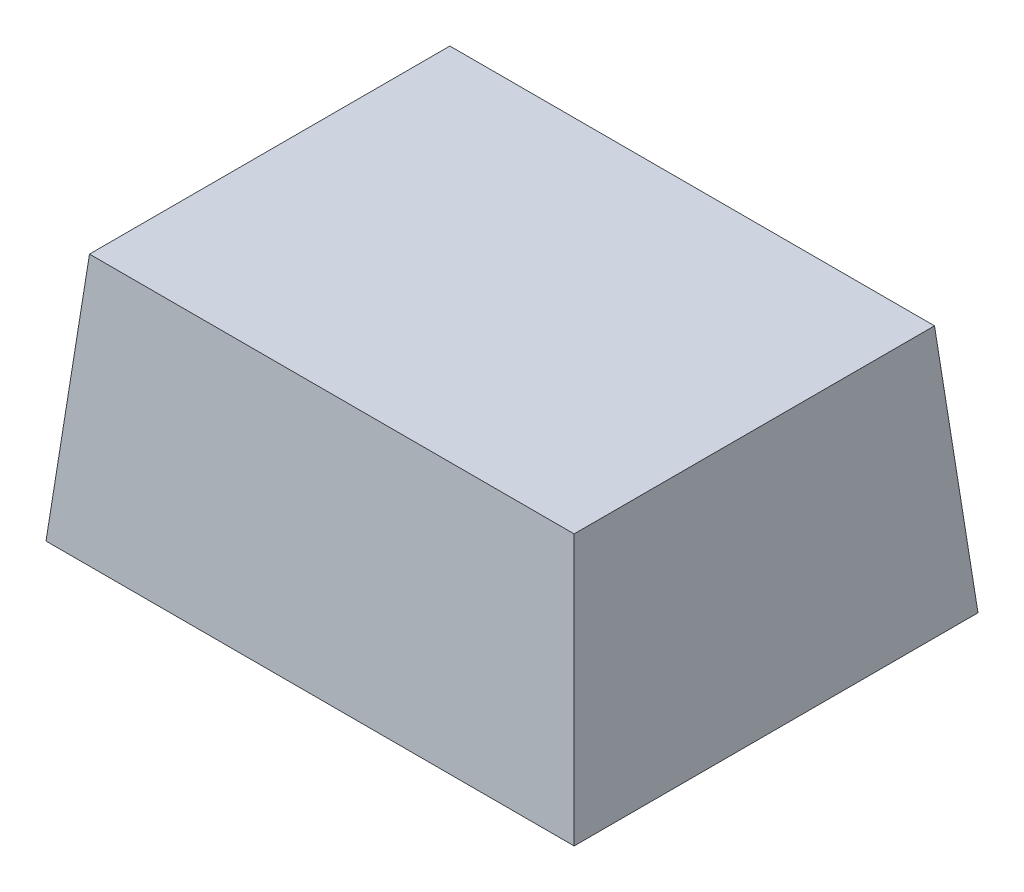
ISO-10303-21;
HEADER;
FILE_DESCRIPTION(('STEP AP214'),'2;1');
FILE_NAME('part.step','',(''),(''),'','','');
FILE_SCHEMA(('AUTOMOTIVE_DESIGN { 1 0 10303 214 1 1 1 1 }'));
ENDSEC;
DATA;
#1=APPLICATION_CONTEXT('core data for automotive mechanical design processes');
#2=APPLICATION_PROTOCOL_DEFINITION('international standard','automotive_design',2000,#1);
#3=PRODUCT_CONTEXT('',#1,'mechanical');
#4=PRODUCT('Part','Part','',(#3));
#5=PRODUCT_RELATED_PRODUCT_CATEGORY('part','',(#4));
#6=PRODUCT_DEFINITION_FORMATION('','',#4);
#7=PRODUCT_DEFINITION_CONTEXT('part definition',#1,'design');
#8=PRODUCT_DEFINITION('design','',#6,#7);
#9=PRODUCT_DEFINITION_SHAPE('','',#8);
#10=(LENGTH_UNIT() NAMED_UNIT(*) SI_UNIT(.MILLI.,.METRE.));
#11=(NAMED_UNIT(*) PLANE_ANGLE_UNIT() SI_UNIT($,.RADIAN.));
#12=(NAMED_UNIT(*) SI_UNIT($,.STERADIAN.) SOLID_ANGLE_UNIT());
#13=UNCERTAINTY_MEASURE_WITH_UNIT(LENGTH_MEASURE(1.E-05),#10,'distance_accuracy_value','');
#14=(GEOMETRIC_REPRESENTATION_CONTEXT(3) GLOBAL_UNCERTAINTY_ASSIGNED_CONTEXT((#13)) GLOBAL_UNIT_ASSIGNED_CONTEXT((#10,
#11,#12)) REPRESENTATION_CONTEXT('',''));
#15=CARTESIAN_POINT('',(0.,0.,0.));
#16=DIRECTION('',(0.,0.,1.));
#17=DIRECTION('',(1.,0.,0.));
#18=AXIS2_PLACEMENT_3D('',#15,#16,#17);
#19=CARTESIAN_POINT('',(0.425,0.,0.325));
#20=DIRECTION('',(0.996194698091746,0.0871557427476582,0.));
#21=DIRECTION('',(-0.0871557427476582,0.996194698091746,0.));
#22=AXIS2_PLACEMENT_3D('',#19,#20,#21);
#23=PLANE('',#22);
#24=DIRECTION('',(0.,0.,-1.));
#25=VECTOR('',#24,1.);
#26=CARTESIAN_POINT('',(0.425,0.,0.325));
#27=LINE('',#26,#25);
#28=CARTESIAN_POINT('',(0.425,0.,0.325));
#29=VERTEX_POINT('',#28);
#30=CARTESIAN_POINT('',(0.425,0.,-0.325));
#31=VERTEX_POINT('',#30);
#32=EDGE_CURVE('E86',#29,#31,#27,.T.);
#33=ORIENTED_EDGE('',*,*,#32,.T.);
#34=DIRECTION('',(0.0868265938642476,-0.992432509138967,-0.0868265938642476));
#35=VECTOR('',#34,1.);
#36=CARTESIAN_POINT('',(0.418591971208243,0.0732441042473825,-0.318591971208243));
#37=LINE('',#36,#35);
#38=CARTESIAN_POINT('',(0.39000453458963,0.4,-0.29000453458963));
#39=VERTEX_POINT('',#38);
#40=EDGE_CURVE('E11',#39,#31,#37,.T.);
#41=ORIENTED_EDGE('',*,*,#40,.F.);
#42=DIRECTION('',(0.,0.,1.));
#43=VECTOR('',#42,1.);
#44=CARTESIAN_POINT('',(0.39000453458963,0.4,0.));
#45=LINE('',#44,#43);
#46=CARTESIAN_POINT('',(0.39000453458963,0.4,0.29000453458963));
#47=VERTEX_POINT('',#46);
#48=EDGE_CURVE('E106',#47,#39,#45,.F.);
#49=ORIENTED_EDGE('',*,*,#48,.F.);
#50=DIRECTION('',(0.0868265938642476,-0.992432509138967,0.0868265938642476));
#51=VECTOR('',#50,1.);
#52=CARTESIAN_POINT('',(0.425,0.,0.325));
#53=LINE('',#52,#51);
#54=EDGE_CURVE('E98',#47,#29,#53,.T.);
#55=ORIENTED_EDGE('',*,*,#54,.T.);
#56=EDGE_LOOP('',(#33,#41,#49,#55));
#57=FACE_BOUND('',#56,.T.);
#58=ADVANCED_FACE('F39',(#57),#23,.T.);
#59=CARTESIAN_POINT('',(-0.425,0.,-0.325));
#60=DIRECTION('',(0.,0.0871557427476582,-0.996194698091746));
#61=DIRECTION('',(0.,0.996194698091746,0.0871557427476582));
#62=AXIS2_PLACEMENT_3D('',#59,#60,#61);
#63=PLANE('',#62);
#64=DIRECTION('',(-1.,0.,0.));
#65=VECTOR('',#64,1.);
#66=CARTESIAN_POINT('',(-0.425,0.,-0.325));
#67=LINE('',#66,#65);
#68=CARTESIAN_POINT('',(-0.425,0.,-0.325));
#69=VERTEX_POINT('',#68);
#70=EDGE_CURVE('E82',#31,#69,#67,.T.);
#71=ORIENTED_EDGE('',*,*,#70,.T.);
#72=DIRECTION('',(-0.0868265938642476,-0.992432509138967,-0.0868265938642476));
#73=VECTOR('',#72,1.);
#74=CARTESIAN_POINT('',(-0.420099742688656,0.0560101973656455,-0.320099742688657));
#75=LINE('',#74,#73);
#76=CARTESIAN_POINT('',(-0.39000453458963,0.4,-0.29000453458963));
#77=VERTEX_POINT('',#76);
#78=EDGE_CURVE('E49',#77,#69,#75,.T.);
#79=ORIENTED_EDGE('',*,*,#78,.F.);
#80=DIRECTION('',(1.,0.,0.));
#81=VECTOR('',#80,1.);
#82=CARTESIAN_POINT('',(0.,0.4,-0.29000453458963));
#83=LINE('',#82,#81);
#84=EDGE_CURVE('E94',#39,#77,#83,.F.);
#85=ORIENTED_EDGE('',*,*,#84,.F.);
#86=ORIENTED_EDGE('',*,*,#40,.T.);
#87=EDGE_LOOP('',(#71,#79,#85,#86));
#88=FACE_BOUND('',#87,.T.);
#89=ADVANCED_FACE('F41',(#88),#63,.T.);
#90=CARTESIAN_POINT('',(-0.425,0.,0.325));
#91=DIRECTION('',(-0.996194698091746,0.0871557427476582,0.));
#92=DIRECTION('',(-0.0871557427476582,-0.996194698091746,0.));
#93=AXIS2_PLACEMENT_3D('',#90,#91,#92);
#94=PLANE('',#93);
#95=DIRECTION('',(0.,0.,1.));
#96=VECTOR('',#95,1.);
#97=CARTESIAN_POINT('',(-0.425,0.,0.325));
#98=LINE('',#97,#96);
#99=CARTESIAN_POINT('',(-0.425,0.,0.325));
#100=VERTEX_POINT('',#99);
#101=EDGE_CURVE('E87',#69,#100,#98,.T.);
#102=ORIENTED_EDGE('',*,*,#101,.T.);
#103=DIRECTION('',(-0.0868265938642476,-0.992432509138967,0.0868265938642476));
#104=VECTOR('',#103,1.);
#105=CARTESIAN_POINT('',(-0.425,0.,0.325));
#106=LINE('',#105,#104);
#107=CARTESIAN_POINT('',(-0.39000453458963,0.4,0.29000453458963));
#108=VERTEX_POINT('',#107);
#109=EDGE_CURVE('E110',#108,#100,#106,.T.);
#110=ORIENTED_EDGE('',*,*,#109,.F.);
#111=DIRECTION('',(0.,0.,-1.));
#112=VECTOR('',#111,1.);
#113=CARTESIAN_POINT('',(-0.39000453458963,0.4,0.));
#114=LINE('',#113,#112);
#115=EDGE_CURVE('E61',#77,#108,#114,.F.);
#116=ORIENTED_EDGE('',*,*,#115,.F.);
#117=ORIENTED_EDGE('',*,*,#78,.T.);
#118=EDGE_LOOP('',(#102,#110,#116,#117));
#119=FACE_BOUND('',#118,.T.);
#120=ADVANCED_FACE('F123',(#119),#94,.T.);
#121=CARTESIAN_POINT('',(-0.425,0.,0.325));
#122=DIRECTION('',(0.,0.0871557427476582,0.996194698091746));
#123=DIRECTION('',(0.,-0.996194698091746,0.0871557427476582));
#124=AXIS2_PLACEMENT_3D('',#121,#122,#123);
#125=PLANE('',#124);
#126=DIRECTION('',(1.,0.,0.));
#127=VECTOR('',#126,1.);
#128=CARTESIAN_POINT('',(-0.425,0.,0.325));
#129=LINE('',#128,#127);
#130=EDGE_CURVE('E104',#100,#29,#129,.T.);
#131=ORIENTED_EDGE('',*,*,#130,.T.);
#132=ORIENTED_EDGE('',*,*,#54,.F.);
#133=DIRECTION('',(-1.,0.,0.));
#134=VECTOR('',#133,1.);
#135=CARTESIAN_POINT('',(0.,0.4,0.29000453458963));
#136=LINE('',#135,#134);
#137=EDGE_CURVE('E43',#108,#47,#136,.F.);
#138=ORIENTED_EDGE('',*,*,#137,.F.);
#139=ORIENTED_EDGE('',*,*,#109,.T.);
#140=EDGE_LOOP('',(#131,#132,#138,#139));
#141=FACE_BOUND('',#140,.T.);
#142=ADVANCED_FACE('F125',(#141),#125,.T.);
#143=CARTESIAN_POINT('',(0.,0.4,0.));
#144=DIRECTION('',(0.,-1.,0.));
#145=DIRECTION('',(0.,0.,-1.));
#146=AXIS2_PLACEMENT_3D('',#143,#144,#145);
#147=PLANE('',#146);
#148=ORIENTED_EDGE('',*,*,#48,.T.);
#149=ORIENTED_EDGE('',*,*,#84,.T.);
#150=ORIENTED_EDGE('',*,*,#115,.T.);
#151=ORIENTED_EDGE('',*,*,#137,.T.);
#152=EDGE_LOOP('',(#148,#149,#150,#151));
#153=FACE_BOUND('',#152,.T.);
#154=ADVANCED_FACE('F121',(#153),#147,.F.);
#155=CARTESIAN_POINT('',(0.,0.,0.));
#156=DIRECTION('',(0.,-1.,0.));
#157=DIRECTION('',(0.,0.,-1.));
#158=AXIS2_PLACEMENT_3D('',#155,#156,#157);
#159=PLANE('',#158);
#160=ORIENTED_EDGE('',*,*,#32,.F.);
#161=ORIENTED_EDGE('',*,*,#130,.F.);
#162=ORIENTED_EDGE('',*,*,#101,.F.);
#163=ORIENTED_EDGE('',*,*,#70,.F.);
#164=EDGE_LOOP('',(#160,#161,#162,#163));
#165=FACE_BOUND('',#164,.T.);
#166=ADVANCED_FACE('F83',(#165),#159,.T.);
#167=CLOSED_SHELL('',(#58,#89,#120,#142,#154,#166));
#168=MANIFOLD_SOLID_BREP('B2',#167);
#169=ADVANCED_BREP_SHAPE_REPRESENTATION('',(#18,#168),#14);
#170=SHAPE_DEFINITION_REPRESENTATION(#9,#169);
ENDSEC;
END-ISO-10303-21;
